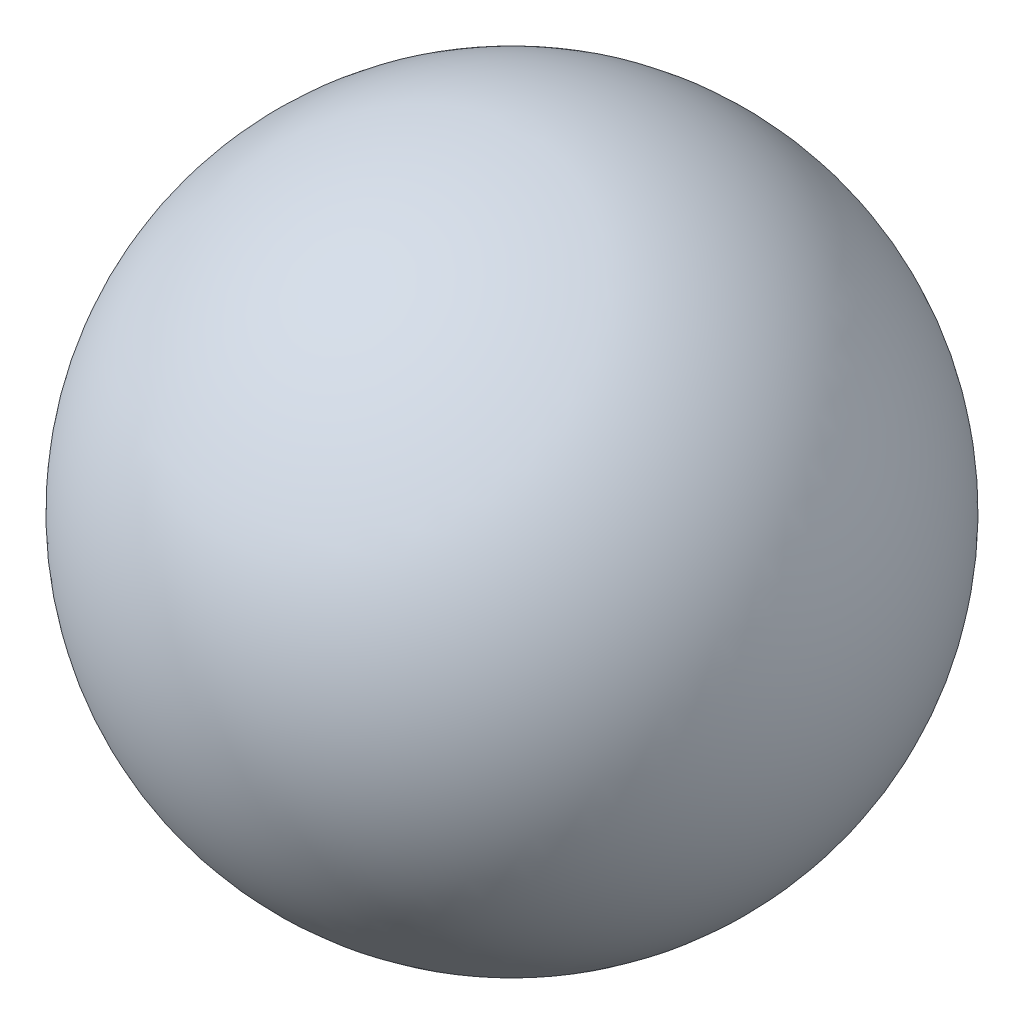
ISO-10303-21;
HEADER;
FILE_DESCRIPTION(('STEP AP214'),'2;1');
FILE_NAME('part.step','',(''),(''),'','','');
FILE_SCHEMA(('AUTOMOTIVE_DESIGN { 1 0 10303 214 1 1 1 1 }'));
ENDSEC;
DATA;
#1=APPLICATION_CONTEXT('core data for automotive mechanical design processes');
#2=APPLICATION_PROTOCOL_DEFINITION('international standard','automotive_design',2000,#1);
#3=PRODUCT_CONTEXT('',#1,'mechanical');
#4=PRODUCT('Part','Part','',(#3));
#5=PRODUCT_RELATED_PRODUCT_CATEGORY('part','',(#4));
#6=PRODUCT_DEFINITION_FORMATION('','',#4);
#7=PRODUCT_DEFINITION_CONTEXT('part definition',#1,'design');
#8=PRODUCT_DEFINITION('design','',#6,#7);
#9=PRODUCT_DEFINITION_SHAPE('','',#8);
#10=(LENGTH_UNIT() NAMED_UNIT(*) SI_UNIT(.MILLI.,.METRE.));
#11=(NAMED_UNIT(*) PLANE_ANGLE_UNIT() SI_UNIT($,.RADIAN.));
#12=(NAMED_UNIT(*) SI_UNIT($,.STERADIAN.) SOLID_ANGLE_UNIT());
#13=UNCERTAINTY_MEASURE_WITH_UNIT(LENGTH_MEASURE(1.E-05),#10,'distance_accuracy_value','');
#14=(GEOMETRIC_REPRESENTATION_CONTEXT(3) GLOBAL_UNCERTAINTY_ASSIGNED_CONTEXT((#13)) GLOBAL_UNIT_ASSIGNED_CONTEXT((#10,
#11,#12)) REPRESENTATION_CONTEXT('',''));
#15=CARTESIAN_POINT('',(0.,0.,0.));
#16=DIRECTION('',(0.,0.,1.));
#17=DIRECTION('',(1.,0.,0.));
#18=AXIS2_PLACEMENT_3D('',#15,#16,#17);
#19=CARTESIAN_POINT('',(0.,64.9370703065668,0.));
#20=DIRECTION('',(0.,1.,0.));
#21=DIRECTION('',(0.,0.,-1.));
#22=AXIS2_PLACEMENT_3D('',#19,#20,#21);
#23=SPHERICAL_SURFACE('',#22,76.2);
#24=CARTESIAN_POINT('',(0.,0.,0.));
#25=DIRECTION('',(0.,1.,0.));
#26=DIRECTION('',(0.,0.,1.));
#27=AXIS2_PLACEMENT_3D('',#24,#25,#26);
#28=CIRCLE('',#27,39.87);
#29=CARTESIAN_POINT('',(0.,0.,39.87));
#30=VERTEX_POINT('',#29);
#31=EDGE_CURVE('E10',#30,#30,#28,.T.);
#32=ORIENTED_EDGE('',*,*,#31,.T.);
#33=EDGE_LOOP('',(#32));
#34=FACE_BOUND('',#33,.T.);
#35=ADVANCED_FACE('F37',(#34),#23,.T.);
#36=CARTESIAN_POINT('',(0.,141.137070306567,0.));
#37=DIRECTION('',(0.,1.,0.));
#38=DIRECTION('',(0.,0.,1.));
#39=AXIS2_PLACEMENT_3D('',#36,#37,#38);
#40=CYLINDRICAL_SURFACE('',#39,39.87);
#41=ORIENTED_EDGE('',*,*,#31,.F.);
#42=EDGE_LOOP('',(#41));
#43=FACE_BOUND('',#42,.T.);
#44=CARTESIAN_POINT('',(0.,6.00000000000001,0.));
#45=DIRECTION('',(0.,1.,0.));
#46=DIRECTION('',(0.,0.,1.));
#47=AXIS2_PLACEMENT_3D('',#44,#45,#46);
#48=CIRCLE('',#47,39.87);
#49=CARTESIAN_POINT('',(0.,6.,39.87));
#50=VERTEX_POINT('',#49);
#51=EDGE_CURVE('E44',#50,#50,#48,.T.);
#52=ORIENTED_EDGE('',*,*,#51,.T.);
#53=EDGE_LOOP('',(#52));
#54=FACE_BOUND('',#53,.T.);
#55=ADVANCED_FACE('F110',(#43,#54),#40,.F.);
#56=CARTESIAN_POINT('',(0.,6.,-39.87));
#57=DIRECTION('',(0.,1.,0.));
#58=DIRECTION('',(0.,0.,1.));
#59=AXIS2_PLACEMENT_3D('',#56,#57,#58);
#60=PLANE('',#59);
#61=CARTESIAN_POINT('',(0.,6.,35.56));
#62=DIRECTION('',(0.,-1.,0.));
#63=DIRECTION('',(0.,0.,-1.));
#64=AXIS2_PLACEMENT_3D('',#61,#62,#63);
#65=CIRCLE('',#64,1.9);
#66=CARTESIAN_POINT('',(0.,6.,33.66));
#67=VERTEX_POINT('',#66);
#68=EDGE_CURVE('E89',#67,#67,#65,.T.);
#69=ORIENTED_EDGE('',*,*,#68,.F.);
#70=EDGE_LOOP('',(#69));
#71=FACE_BOUND('',#70,.T.);
#72=CARTESIAN_POINT('',(35.560000000001,6.,1.00451111535826E-12));
#73=DIRECTION('',(0.,-1.,0.));
#74=DIRECTION('',(0.,0.,-1.));
#75=AXIS2_PLACEMENT_3D('',#72,#73,#74);
#76=CIRCLE('',#75,1.90000000000078);
#77=CARTESIAN_POINT('',(35.560000000001,6.,-1.89999999999978));
#78=VERTEX_POINT('',#77);
#79=EDGE_CURVE('E81',#78,#78,#76,.T.);
#80=ORIENTED_EDGE('',*,*,#79,.F.);
#81=EDGE_LOOP('',(#80));
#82=FACE_BOUND('',#81,.T.);
#83=CARTESIAN_POINT('',(2.00828744263703E-12,6.,-35.56));
#84=DIRECTION('',(0.,-1.,0.));
#85=DIRECTION('',(0.,0.,-1.));
#86=AXIS2_PLACEMENT_3D('',#83,#84,#85);
#87=CIRCLE('',#86,1.90000000000216);
#88=CARTESIAN_POINT('',(2.00828744263703E-12,6.,-37.4600000000022));
#89=VERTEX_POINT('',#88);
#90=EDGE_CURVE('E73',#89,#89,#87,.T.);
#91=ORIENTED_EDGE('',*,*,#90,.F.);
#92=EDGE_LOOP('',(#91));
#93=FACE_BOUND('',#92,.T.);
#94=CARTESIAN_POINT('',(-35.559999999999,6.,-1.00813117129654E-12));
#95=DIRECTION('',(0.,-1.,0.));
#96=DIRECTION('',(0.,0.,-1.));
#97=AXIS2_PLACEMENT_3D('',#94,#95,#96);
#98=CIRCLE('',#97,1.90000000000161);
#99=CARTESIAN_POINT('',(-35.559999999999,6.,-1.90000000000262));
#100=VERTEX_POINT('',#99);
#101=EDGE_CURVE('E65',#100,#100,#98,.T.);
#102=ORIENTED_EDGE('',*,*,#101,.F.);
#103=EDGE_LOOP('',(#102));
#104=FACE_BOUND('',#103,.T.);
#105=ORIENTED_EDGE('',*,*,#51,.F.);
#106=EDGE_LOOP('',(#105));
#107=FACE_BOUND('',#106,.T.);
#108=CARTESIAN_POINT('',(0.,6.00000000000001,0.));
#109=DIRECTION('',(0.,1.,0.));
#110=DIRECTION('',(0.,0.,1.));
#111=AXIS2_PLACEMENT_3D('',#108,#109,#110);
#112=CIRCLE('',#111,31.75);
#113=CARTESIAN_POINT('',(0.,6.,31.75));
#114=VERTEX_POINT('',#113);
#115=EDGE_CURVE('E49',#114,#114,#112,.T.);
#116=ORIENTED_EDGE('',*,*,#115,.T.);
#117=EDGE_LOOP('',(#116));
#118=FACE_BOUND('',#117,.T.);
#119=ADVANCED_FACE('F106',(#71,#82,#93,#104,#107,#118),#60,.F.);
#120=CARTESIAN_POINT('',(0.,141.137070306567,0.));
#121=DIRECTION('',(0.,1.,0.));
#122=DIRECTION('',(0.,0.,1.));
#123=AXIS2_PLACEMENT_3D('',#120,#121,#122);
#124=CYLINDRICAL_SURFACE('',#123,31.75);
#125=ORIENTED_EDGE('',*,*,#115,.F.);
#126=EDGE_LOOP('',(#125));
#127=FACE_BOUND('',#126,.T.);
#128=CARTESIAN_POINT('',(0.,10.,0.));
#129=DIRECTION('',(0.,1.,0.));
#130=DIRECTION('',(0.,0.,1.));
#131=AXIS2_PLACEMENT_3D('',#128,#129,#130);
#132=CIRCLE('',#131,31.75);
#133=CARTESIAN_POINT('',(0.,10.,31.75));
#134=VERTEX_POINT('',#133);
#135=EDGE_CURVE('E54',#134,#134,#132,.T.);
#136=ORIENTED_EDGE('',*,*,#135,.T.);
#137=EDGE_LOOP('',(#136));
#138=FACE_BOUND('',#137,.T.);
#139=ADVANCED_FACE('F109',(#127,#138),#124,.F.);
#140=CARTESIAN_POINT('',(0.,10.,-31.75));
#141=DIRECTION('',(0.,-1.,0.));
#142=DIRECTION('',(0.,0.,-1.));
#143=AXIS2_PLACEMENT_3D('',#140,#141,#142);
#144=PLANE('',#143);
#145=ORIENTED_EDGE('',*,*,#135,.F.);
#146=EDGE_LOOP('',(#145));
#147=FACE_BOUND('',#146,.T.);
#148=CARTESIAN_POINT('',(0.,10.,0.));
#149=DIRECTION('',(0.,1.,0.));
#150=DIRECTION('',(0.,0.,1.));
#151=AXIS2_PLACEMENT_3D('',#148,#149,#150);
#152=CIRCLE('',#151,50.6162849894314);
#153=CARTESIAN_POINT('',(0.,10.,50.6162849894314));
#154=VERTEX_POINT('',#153);
#155=EDGE_CURVE('E60',#154,#154,#152,.T.);
#156=ORIENTED_EDGE('',*,*,#155,.T.);
#157=EDGE_LOOP('',(#156));
#158=FACE_BOUND('',#157,.T.);
#159=ADVANCED_FACE('F123',(#147,#158),#144,.F.);
#160=CARTESIAN_POINT('',(0.,64.9370703065668,0.));
#161=DIRECTION('',(0.,1.,0.));
#162=DIRECTION('',(0.,0.,1.));
#163=AXIS2_PLACEMENT_3D('',#160,#161,#162);
#164=SPHERICAL_SURFACE('',#163,74.7);
#165=ORIENTED_EDGE('',*,*,#155,.F.);
#166=EDGE_LOOP('',(#165));
#167=FACE_BOUND('',#166,.T.);
#168=ADVANCED_FACE('F129',(#167),#164,.F.);
#169=CARTESIAN_POINT('',(-35.559999999999,8.54,-1.00797564115305E-12));
#170=DIRECTION('',(0.,-1.,0.));
#171=DIRECTION('',(0.,0.,-1.));
#172=AXIS2_PLACEMENT_3D('',#169,#170,#171);
#173=CYLINDRICAL_SURFACE('',#172,1.90000000000161);
#174=CARTESIAN_POINT('',(-35.559999999999,8.54,-1.00797564115305E-12));
#175=DIRECTION('',(0.,-1.,0.));
#176=DIRECTION('',(0.,0.,-1.));
#177=AXIS2_PLACEMENT_3D('',#174,#175,#176);
#178=CIRCLE('',#177,1.90000000000161);
#179=CARTESIAN_POINT('',(-35.559999999999,8.54,-1.90000000000262));
#180=VERTEX_POINT('',#179);
#181=EDGE_CURVE('E69',#180,#180,#178,.T.);
#182=ORIENTED_EDGE('',*,*,#181,.F.);
#183=EDGE_LOOP('',(#182));
#184=FACE_BOUND('',#183,.T.);
#185=ORIENTED_EDGE('',*,*,#101,.T.);
#186=EDGE_LOOP('',(#185));
#187=FACE_BOUND('',#186,.T.);
#188=ADVANCED_FACE('F134',(#184,#187),#173,.F.);
#189=CARTESIAN_POINT('',(-35.559999999999,8.54,-1.00797564115305E-12));
#190=DIRECTION('',(0.,-1.,0.));
#191=DIRECTION('',(0.,0.,-1.));
#192=AXIS2_PLACEMENT_3D('',#189,#190,#191);
#193=PLANE('',#192);
#194=ORIENTED_EDGE('',*,*,#181,.T.);
#195=EDGE_LOOP('',(#194));
#196=FACE_BOUND('',#195,.T.);
#197=ADVANCED_FACE('F139',(#196),#193,.T.);
#198=CARTESIAN_POINT('',(2.00828744263703E-12,8.54,-35.56));
#199=DIRECTION('',(0.,-1.,0.));
#200=DIRECTION('',(0.,0.,-1.));
#201=AXIS2_PLACEMENT_3D('',#198,#199,#200);
#202=CYLINDRICAL_SURFACE('',#201,1.90000000000216);
#203=CARTESIAN_POINT('',(2.00828744263703E-12,8.54,-35.56));
#204=DIRECTION('',(0.,-1.,0.));
#205=DIRECTION('',(0.,0.,-1.));
#206=AXIS2_PLACEMENT_3D('',#203,#204,#205);
#207=CIRCLE('',#206,1.90000000000216);
#208=CARTESIAN_POINT('',(2.00828744263703E-12,8.54,-37.4600000000022));
#209=VERTEX_POINT('',#208);
#210=EDGE_CURVE('E77',#209,#209,#207,.T.);
#211=ORIENTED_EDGE('',*,*,#210,.F.);
#212=EDGE_LOOP('',(#211));
#213=FACE_BOUND('',#212,.T.);
#214=ORIENTED_EDGE('',*,*,#90,.T.);
#215=EDGE_LOOP('',(#214));
#216=FACE_BOUND('',#215,.T.);
#217=ADVANCED_FACE('F180',(#213,#216),#202,.F.);
#218=CARTESIAN_POINT('',(2.00828744263703E-12,8.54,-35.56));
#219=DIRECTION('',(0.,-1.,0.));
#220=DIRECTION('',(0.,0.,-1.));
#221=AXIS2_PLACEMENT_3D('',#218,#219,#220);
#222=PLANE('',#221);
#223=ORIENTED_EDGE('',*,*,#210,.T.);
#224=EDGE_LOOP('',(#223));
#225=FACE_BOUND('',#224,.T.);
#226=ADVANCED_FACE('F189',(#225),#222,.T.);
#227=CARTESIAN_POINT('',(35.560000000001,8.54,1.00466664550175E-12));
#228=DIRECTION('',(0.,-1.,0.));
#229=DIRECTION('',(0.,0.,-1.));
#230=AXIS2_PLACEMENT_3D('',#227,#228,#229);
#231=CYLINDRICAL_SURFACE('',#230,1.90000000000078);
#232=CARTESIAN_POINT('',(35.560000000001,8.54,1.00466664550175E-12));
#233=DIRECTION('',(0.,-1.,0.));
#234=DIRECTION('',(0.,0.,-1.));
#235=AXIS2_PLACEMENT_3D('',#232,#233,#234);
#236=CIRCLE('',#235,1.90000000000078);
#237=CARTESIAN_POINT('',(35.560000000001,8.54,-1.89999999999978));
#238=VERTEX_POINT('',#237);
#239=EDGE_CURVE('E85',#238,#238,#236,.T.);
#240=ORIENTED_EDGE('',*,*,#239,.F.);
#241=EDGE_LOOP('',(#240));
#242=FACE_BOUND('',#241,.T.);
#243=ORIENTED_EDGE('',*,*,#79,.T.);
#244=EDGE_LOOP('',(#243));
#245=FACE_BOUND('',#244,.T.);
#246=ADVANCED_FACE('F198',(#242,#245),#231,.F.);
#247=CARTESIAN_POINT('',(35.560000000001,8.54,1.00466664550175E-12));
#248=DIRECTION('',(0.,-1.,0.));
#249=DIRECTION('',(0.,0.,-1.));
#250=AXIS2_PLACEMENT_3D('',#247,#248,#249);
#251=PLANE('',#250);
#252=ORIENTED_EDGE('',*,*,#239,.T.);
#253=EDGE_LOOP('',(#252));
#254=FACE_BOUND('',#253,.T.);
#255=ADVANCED_FACE('F102',(#254),#251,.T.);
#256=CARTESIAN_POINT('',(0.,8.54,35.56));
#257=DIRECTION('',(0.,-1.,0.));
#258=DIRECTION('',(0.,0.,-1.));
#259=AXIS2_PLACEMENT_3D('',#256,#257,#258);
#260=CYLINDRICAL_SURFACE('',#259,1.9);
#261=CARTESIAN_POINT('',(0.,8.54,35.56));
#262=DIRECTION('',(0.,-1.,0.));
#263=DIRECTION('',(0.,0.,-1.));
#264=AXIS2_PLACEMENT_3D('',#261,#262,#263);
#265=CIRCLE('',#264,1.9);
#266=CARTESIAN_POINT('',(0.,8.54,33.66));
#267=VERTEX_POINT('',#266);
#268=EDGE_CURVE('E64',#267,#267,#265,.T.);
#269=ORIENTED_EDGE('',*,*,#268,.F.);
#270=EDGE_LOOP('',(#269));
#271=FACE_BOUND('',#270,.T.);
#272=ORIENTED_EDGE('',*,*,#68,.T.);
#273=EDGE_LOOP('',(#272));
#274=FACE_BOUND('',#273,.T.);
#275=ADVANCED_FACE('F99',(#271,#274),#260,.F.);
#276=CARTESIAN_POINT('',(0.,8.54,35.56));
#277=DIRECTION('',(0.,-1.,0.));
#278=DIRECTION('',(0.,0.,-1.));
#279=AXIS2_PLACEMENT_3D('',#276,#277,#278);
#280=PLANE('',#279);
#281=ORIENTED_EDGE('',*,*,#268,.T.);
#282=EDGE_LOOP('',(#281));
#283=FACE_BOUND('',#282,.T.);
#284=ADVANCED_FACE('F97',(#283),#280,.T.);
#285=CLOSED_SHELL('',(#35,#55,#119,#139,#159,#168,#188,#197,#217,#226,#246,#255,#275,#284));
#286=MANIFOLD_SOLID_BREP('B2',#285);
#287=ADVANCED_BREP_SHAPE_REPRESENTATION('',(#18,#286),#14);
#288=SHAPE_DEFINITION_REPRESENTATION(#9,#287);
ENDSEC;
END-ISO-10303-21;
